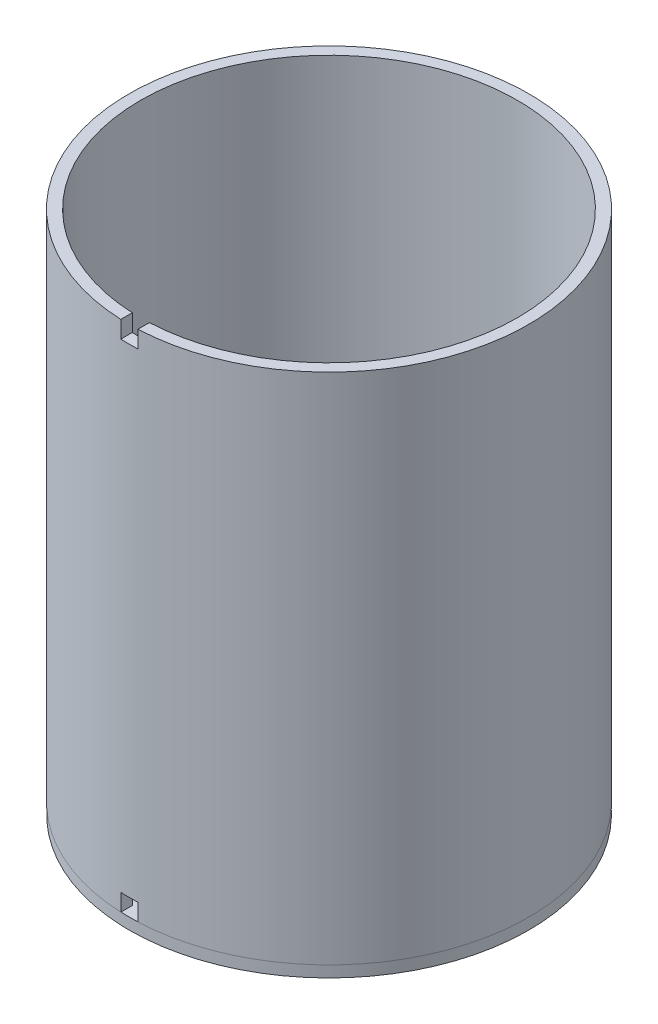
ISO-10303-21;
HEADER;
FILE_DESCRIPTION(('STEP AP214'),'2;1');
FILE_NAME('part.step','',(''),(''),'','','');
FILE_SCHEMA(('AUTOMOTIVE_DESIGN { 1 0 10303 214 1 1 1 1 }'));
ENDSEC;
DATA;
#1=APPLICATION_CONTEXT('core data for automotive mechanical design processes');
#2=APPLICATION_PROTOCOL_DEFINITION('international standard','automotive_design',2000,#1);
#3=PRODUCT_CONTEXT('',#1,'mechanical');
#4=PRODUCT('Part','Part','',(#3));
#5=PRODUCT_RELATED_PRODUCT_CATEGORY('part','',(#4));
#6=PRODUCT_DEFINITION_FORMATION('','',#4);
#7=PRODUCT_DEFINITION_CONTEXT('part definition',#1,'design');
#8=PRODUCT_DEFINITION('design','',#6,#7);
#9=PRODUCT_DEFINITION_SHAPE('','',#8);
#10=(LENGTH_UNIT() NAMED_UNIT(*) SI_UNIT(.MILLI.,.METRE.));
#11=(NAMED_UNIT(*) PLANE_ANGLE_UNIT() SI_UNIT($,.RADIAN.));
#12=(NAMED_UNIT(*) SI_UNIT($,.STERADIAN.) SOLID_ANGLE_UNIT());
#13=UNCERTAINTY_MEASURE_WITH_UNIT(LENGTH_MEASURE(1.E-05),#10,'distance_accuracy_value','');
#14=(GEOMETRIC_REPRESENTATION_CONTEXT(3) GLOBAL_UNCERTAINTY_ASSIGNED_CONTEXT((#13)) GLOBAL_UNIT_ASSIGNED_CONTEXT((#10,
#11,#12)) REPRESENTATION_CONTEXT('',''));
#15=CARTESIAN_POINT('',(0.,0.,0.));
#16=DIRECTION('',(0.,0.,1.));
#17=DIRECTION('',(1.,0.,0.));
#18=AXIS2_PLACEMENT_3D('',#15,#16,#17);
#19=CARTESIAN_POINT('',(0.,233.68,0.));
#20=DIRECTION('',(0.,-1.,0.));
#21=DIRECTION('',(0.,0.,-1.));
#22=AXIS2_PLACEMENT_3D('',#19,#20,#21);
#23=CYLINDRICAL_SURFACE('',#22,88.9698728416405);
#24=CARTESIAN_POINT('',(0.,12.7,0.));
#25=DIRECTION('',(0.,1.,0.));
#26=DIRECTION('',(0.,0.,1.));
#27=AXIS2_PLACEMENT_3D('',#24,#25,#26);
#28=CIRCLE('',#27,88.9698728416405);
#29=CARTESIAN_POINT('',(-3.81000000000005,12.7,88.8882566678956));
#30=VERTEX_POINT('',#29);
#31=CARTESIAN_POINT('',(3.80999999999995,12.7,88.8882566678956));
#32=VERTEX_POINT('',#31);
#33=EDGE_CURVE('E111',#30,#32,#28,.T.);
#34=ORIENTED_EDGE('',*,*,#33,.T.);
#35=DIRECTION('',(0.,-1.,0.));
#36=VECTOR('',#35,1.);
#37=CARTESIAN_POINT('',(3.8100000000001,233.68,88.8882566678956));
#38=LINE('',#37,#36);
#39=CARTESIAN_POINT('',(3.8100000000001,5.08,88.8882566678956));
#40=VERTEX_POINT('',#39);
#41=EDGE_CURVE('E114',#40,#32,#38,.F.);
#42=ORIENTED_EDGE('',*,*,#41,.F.);
#43=CARTESIAN_POINT('',(0.,5.08,0.));
#44=DIRECTION('',(0.,1.,0.));
#45=DIRECTION('',(0.,0.,1.));
#46=AXIS2_PLACEMENT_3D('',#43,#44,#45);
#47=CIRCLE('',#46,88.9698728416405);
#48=CARTESIAN_POINT('',(-3.81000000000005,5.08,88.8882566678956));
#49=VERTEX_POINT('',#48);
#50=EDGE_CURVE('E169',#40,#49,#47,.T.);
#51=ORIENTED_EDGE('',*,*,#50,.T.);
#52=DIRECTION('',(0.,-1.,0.));
#53=VECTOR('',#52,1.);
#54=CARTESIAN_POINT('',(-3.81000000000008,233.68,88.8882566678956));
#55=LINE('',#54,#53);
#56=EDGE_CURVE('E116',#49,#30,#55,.F.);
#57=ORIENTED_EDGE('',*,*,#56,.T.);
#58=EDGE_LOOP('',(#34,#42,#51,#57));
#59=FACE_BOUND('',#58,.T.);
#60=CARTESIAN_POINT('',(0.,233.68,0.));
#61=DIRECTION('',(0.,1.,0.));
#62=DIRECTION('',(0.,0.,1.));
#63=AXIS2_PLACEMENT_3D('',#60,#61,#62);
#64=CIRCLE('',#63,88.9698728416405);
#65=CARTESIAN_POINT('',(3.80999999999994,233.68,88.8882566678956));
#66=VERTEX_POINT('',#65);
#67=CARTESIAN_POINT('',(-3.81000000000005,233.68,88.8882566678956));
#68=VERTEX_POINT('',#67);
#69=EDGE_CURVE('E170',#66,#68,#64,.T.);
#70=ORIENTED_EDGE('',*,*,#69,.F.);
#71=DIRECTION('',(0.,-1.,0.));
#72=VECTOR('',#71,1.);
#73=CARTESIAN_POINT('',(3.80999999999994,233.68,88.8882566678956));
#74=LINE('',#73,#72);
#75=CARTESIAN_POINT('',(3.80999999999995,226.06,88.8882566678956));
#76=VERTEX_POINT('',#75);
#77=EDGE_CURVE('E161',#66,#76,#74,.T.);
#78=ORIENTED_EDGE('',*,*,#77,.T.);
#79=CARTESIAN_POINT('',(0.,226.06,0.));
#80=DIRECTION('',(0.,1.,0.));
#81=DIRECTION('',(0.,0.,1.));
#82=AXIS2_PLACEMENT_3D('',#79,#80,#81);
#83=CIRCLE('',#82,88.9698728416405);
#84=CARTESIAN_POINT('',(-3.81000000000005,226.06,88.8882566678956));
#85=VERTEX_POINT('',#84);
#86=EDGE_CURVE('E122',#85,#76,#83,.T.);
#87=ORIENTED_EDGE('',*,*,#86,.F.);
#88=DIRECTION('',(0.,-1.,0.));
#89=VECTOR('',#88,1.);
#90=CARTESIAN_POINT('',(-3.81000000000005,233.68,88.8882566678956));
#91=LINE('',#90,#89);
#92=EDGE_CURVE('E157',#68,#85,#91,.T.);
#93=ORIENTED_EDGE('',*,*,#92,.F.);
#94=EDGE_LOOP('',(#70,#78,#87,#93));
#95=FACE_BOUND('',#94,.T.);
#96=ADVANCED_FACE('F39',(#59,#95),#23,.T.);
#97=CARTESIAN_POINT('',(0.,5.08,0.));
#98=DIRECTION('',(0.,1.,0.));
#99=DIRECTION('',(0.,0.,1.));
#100=AXIS2_PLACEMENT_3D('',#97,#98,#99);
#101=PLANE('',#100);
#102=CARTESIAN_POINT('',(0.,5.08,0.));
#103=DIRECTION('',(0.,1.,0.));
#104=DIRECTION('',(0.,0.,1.));
#105=AXIS2_PLACEMENT_3D('',#102,#103,#104);
#106=CIRCLE('',#105,83.8898728416405);
#107=CARTESIAN_POINT('',(-3.81000000000005,5.08,83.8033093940007));
#108=VERTEX_POINT('',#107);
#109=CARTESIAN_POINT('',(3.80999999999994,5.08,83.8033093940007));
#110=VERTEX_POINT('',#109);
#111=EDGE_CURVE('E189',#108,#110,#106,.F.);
#112=ORIENTED_EDGE('',*,*,#111,.F.);
#113=DIRECTION('',(0.,0.,-1.));
#114=VECTOR('',#113,1.);
#115=CARTESIAN_POINT('',(-3.81000000000005,5.08,88.9698728416405));
#116=LINE('',#115,#114);
#117=CARTESIAN_POINT('',(-3.81000000000005,5.08,88.8183196193218));
#118=VERTEX_POINT('',#117);
#119=EDGE_CURVE('E144',#118,#108,#116,.T.);
#120=ORIENTED_EDGE('',*,*,#119,.F.);
#121=CARTESIAN_POINT('',(0.,5.08,0.));
#122=DIRECTION('',(0.,1.,0.));
#123=DIRECTION('',(0.,0.,1.));
#124=AXIS2_PLACEMENT_3D('',#121,#122,#123);
#125=CIRCLE('',#124,88.9);
#126=CARTESIAN_POINT('',(3.80999999999994,5.08,88.8183196193218));
#127=VERTEX_POINT('',#126);
#128=EDGE_CURVE('E128',#118,#127,#125,.T.);
#129=ORIENTED_EDGE('',*,*,#128,.T.);
#130=DIRECTION('',(0.,0.,-1.));
#131=VECTOR('',#130,1.);
#132=CARTESIAN_POINT('',(3.80999999999994,5.08,88.9698728416405));
#133=LINE('',#132,#131);
#134=EDGE_CURVE('E136',#127,#110,#133,.T.);
#135=ORIENTED_EDGE('',*,*,#134,.T.);
#136=EDGE_LOOP('',(#112,#120,#129,#135));
#137=FACE_BOUND('',#136,.T.);
#138=CARTESIAN_POINT('',(0.,5.08,0.));
#139=DIRECTION('',(0.,1.,0.));
#140=DIRECTION('',(0.,0.,1.));
#141=AXIS2_PLACEMENT_3D('',#138,#139,#140);
#142=CIRCLE('',#141,38.1);
#143=CARTESIAN_POINT('',(0.,5.08,38.1));
#144=VERTEX_POINT('',#143);
#145=EDGE_CURVE('E177',#144,#144,#142,.T.);
#146=ORIENTED_EDGE('',*,*,#145,.F.);
#147=EDGE_LOOP('',(#146));
#148=FACE_BOUND('',#147,.T.);
#149=ADVANCED_FACE('F244',(#137,#148),#101,.T.);
#150=CARTESIAN_POINT('',(0.,0.,0.));
#151=DIRECTION('',(0.,1.,0.));
#152=DIRECTION('',(0.,0.,1.));
#153=AXIS2_PLACEMENT_3D('',#150,#151,#152);
#154=PLANE('',#153);
#155=CARTESIAN_POINT('',(0.,0.,0.));
#156=DIRECTION('',(0.,1.,0.));
#157=DIRECTION('',(0.,0.,1.));
#158=AXIS2_PLACEMENT_3D('',#155,#156,#157);
#159=CIRCLE('',#158,88.9);
#160=CARTESIAN_POINT('',(0.,0.,88.9));
#161=VERTEX_POINT('',#160);
#162=EDGE_CURVE('E181',#161,#161,#159,.T.);
#163=ORIENTED_EDGE('',*,*,#162,.F.);
#164=EDGE_LOOP('',(#163));
#165=FACE_BOUND('',#164,.T.);
#166=CARTESIAN_POINT('',(0.,0.,0.));
#167=DIRECTION('',(0.,1.,0.));
#168=DIRECTION('',(0.,0.,1.));
#169=AXIS2_PLACEMENT_3D('',#166,#167,#168);
#170=CIRCLE('',#169,38.1);
#171=CARTESIAN_POINT('',(0.,0.,38.1));
#172=VERTEX_POINT('',#171);
#173=EDGE_CURVE('E174',#172,#172,#170,.T.);
#174=ORIENTED_EDGE('',*,*,#173,.T.);
#175=EDGE_LOOP('',(#174));
#176=FACE_BOUND('',#175,.T.);
#177=ADVANCED_FACE('F263',(#165,#176),#154,.F.);
#178=CARTESIAN_POINT('',(0.,5.08,0.));
#179=DIRECTION('',(0.,-1.,0.));
#180=DIRECTION('',(0.,0.,-1.));
#181=AXIS2_PLACEMENT_3D('',#178,#179,#180);
#182=CYLINDRICAL_SURFACE('',#181,88.9);
#183=CARTESIAN_POINT('',(0.,5.08,0.));
#184=DIRECTION('',(0.,1.,0.));
#185=DIRECTION('',(0.,0.,1.));
#186=AXIS2_PLACEMENT_3D('',#183,#184,#185);
#187=CIRCLE('',#186,88.9);
#188=EDGE_CURVE('E185',#127,#118,#187,.T.);
#189=ORIENTED_EDGE('',*,*,#188,.F.);
#190=ORIENTED_EDGE('',*,*,#128,.F.);
#191=EDGE_LOOP('',(#189,#190));
#192=FACE_BOUND('',#191,.T.);
#193=ORIENTED_EDGE('',*,*,#162,.T.);
#194=EDGE_LOOP('',(#193));
#195=FACE_BOUND('',#194,.T.);
#196=ADVANCED_FACE('F41',(#192,#195),#182,.T.);
#197=CARTESIAN_POINT('',(0.,5.08,0.));
#198=DIRECTION('',(0.,-1.,0.));
#199=DIRECTION('',(0.,0.,-1.));
#200=AXIS2_PLACEMENT_3D('',#197,#198,#199);
#201=CYLINDRICAL_SURFACE('',#200,38.1);
#202=ORIENTED_EDGE('',*,*,#145,.T.);
#203=EDGE_LOOP('',(#202));
#204=FACE_BOUND('',#203,.T.);
#205=ORIENTED_EDGE('',*,*,#173,.F.);
#206=EDGE_LOOP('',(#205));
#207=FACE_BOUND('',#206,.T.);
#208=ADVANCED_FACE('F268',(#204,#207),#201,.F.);
#209=CARTESIAN_POINT('',(0.,233.68,0.));
#210=DIRECTION('',(0.,1.,0.));
#211=DIRECTION('',(0.,0.,1.));
#212=AXIS2_PLACEMENT_3D('',#209,#210,#211);
#213=PLANE('',#212);
#214=DIRECTION('',(0.,0.,-1.));
#215=VECTOR('',#214,1.);
#216=CARTESIAN_POINT('',(3.80999999999994,233.68,88.9698728416405));
#217=LINE('',#216,#215);
#218=CARTESIAN_POINT('',(3.80999999999994,233.68,83.8033093940007));
#219=VERTEX_POINT('',#218);
#220=EDGE_CURVE('E129',#66,#219,#217,.T.);
#221=ORIENTED_EDGE('',*,*,#220,.F.);
#222=ORIENTED_EDGE('',*,*,#69,.T.);
#223=DIRECTION('',(0.,0.,-1.));
#224=VECTOR('',#223,1.);
#225=CARTESIAN_POINT('',(-3.81000000000005,233.68,88.9698728416405));
#226=LINE('',#225,#224);
#227=CARTESIAN_POINT('',(-3.81000000000005,233.68,83.8033093940007));
#228=VERTEX_POINT('',#227);
#229=EDGE_CURVE('E218',#68,#228,#226,.T.);
#230=ORIENTED_EDGE('',*,*,#229,.T.);
#231=CARTESIAN_POINT('',(0.,233.68,0.));
#232=DIRECTION('',(0.,1.,0.));
#233=DIRECTION('',(0.,0.,1.));
#234=AXIS2_PLACEMENT_3D('',#231,#232,#233);
#235=CIRCLE('',#234,83.8898728416405);
#236=EDGE_CURVE('E165',#219,#228,#235,.T.);
#237=ORIENTED_EDGE('',*,*,#236,.F.);
#238=EDGE_LOOP('',(#221,#222,#230,#237));
#239=FACE_BOUND('',#238,.T.);
#240=ADVANCED_FACE('F224',(#239),#213,.T.);
#241=CARTESIAN_POINT('',(0.,5.08,0.));
#242=DIRECTION('',(0.,1.,0.));
#243=DIRECTION('',(0.,0.,1.));
#244=AXIS2_PLACEMENT_3D('',#241,#242,#243);
#245=PLANE('',#244);
#246=ORIENTED_EDGE('',*,*,#188,.T.);
#247=EDGE_CURVE('E147',#49,#118,#116,.T.);
#248=ORIENTED_EDGE('',*,*,#247,.F.);
#249=ORIENTED_EDGE('',*,*,#50,.F.);
#250=EDGE_CURVE('E55',#40,#127,#133,.T.);
#251=ORIENTED_EDGE('',*,*,#250,.T.);
#252=EDGE_LOOP('',(#246,#248,#249,#251));
#253=FACE_BOUND('',#252,.T.);
#254=ADVANCED_FACE('F237',(#253),#245,.F.);
#255=CARTESIAN_POINT('',(0.,233.68,0.));
#256=DIRECTION('',(0.,-1.,0.));
#257=DIRECTION('',(0.,0.,-1.));
#258=AXIS2_PLACEMENT_3D('',#255,#256,#257);
#259=CYLINDRICAL_SURFACE('',#258,83.8898728416405);
#260=DIRECTION('',(0.,-1.,0.));
#261=VECTOR('',#260,1.);
#262=CARTESIAN_POINT('',(3.80999999999994,233.68,83.8033093940007));
#263=LINE('',#262,#261);
#264=CARTESIAN_POINT('',(3.80999999999995,226.06,83.8033093940007));
#265=VERTEX_POINT('',#264);
#266=EDGE_CURVE('E11',#219,#265,#263,.T.);
#267=ORIENTED_EDGE('',*,*,#266,.F.);
#268=ORIENTED_EDGE('',*,*,#236,.T.);
#269=DIRECTION('',(0.,-1.,0.));
#270=VECTOR('',#269,1.);
#271=CARTESIAN_POINT('',(-3.81000000000005,233.68,83.8033093940007));
#272=LINE('',#271,#270);
#273=CARTESIAN_POINT('',(-3.81000000000005,226.06,83.8033093940007));
#274=VERTEX_POINT('',#273);
#275=EDGE_CURVE('E48',#228,#274,#272,.T.);
#276=ORIENTED_EDGE('',*,*,#275,.T.);
#277=CARTESIAN_POINT('',(0.,226.06,0.));
#278=DIRECTION('',(0.,1.,0.));
#279=DIRECTION('',(0.,0.,1.));
#280=AXIS2_PLACEMENT_3D('',#277,#278,#279);
#281=CIRCLE('',#280,83.8898728416405);
#282=EDGE_CURVE('E204',#274,#265,#281,.T.);
#283=ORIENTED_EDGE('',*,*,#282,.T.);
#284=EDGE_LOOP('',(#267,#268,#276,#283));
#285=FACE_BOUND('',#284,.T.);
#286=DIRECTION('',(0.,-1.,0.));
#287=VECTOR('',#286,1.);
#288=CARTESIAN_POINT('',(-3.81000000000008,233.68,83.8033093940007));
#289=LINE('',#288,#287);
#290=CARTESIAN_POINT('',(-3.81000000000005,12.7,83.8033093940007));
#291=VERTEX_POINT('',#290);
#292=EDGE_CURVE('E201',#108,#291,#289,.F.);
#293=ORIENTED_EDGE('',*,*,#292,.F.);
#294=ORIENTED_EDGE('',*,*,#111,.T.);
#295=DIRECTION('',(0.,-1.,0.));
#296=VECTOR('',#295,1.);
#297=CARTESIAN_POINT('',(3.8100000000001,233.68,83.8033093940007));
#298=LINE('',#297,#296);
#299=CARTESIAN_POINT('',(3.8100000000001,12.7,83.8033093940007));
#300=VERTEX_POINT('',#299);
#301=EDGE_CURVE('E196',#110,#300,#298,.F.);
#302=ORIENTED_EDGE('',*,*,#301,.T.);
#303=CARTESIAN_POINT('',(0.,12.7,0.));
#304=DIRECTION('',(0.,1.,0.));
#305=DIRECTION('',(0.,0.,1.));
#306=AXIS2_PLACEMENT_3D('',#303,#304,#305);
#307=CIRCLE('',#306,83.8898728416405);
#308=EDGE_CURVE('E133',#291,#300,#307,.T.);
#309=ORIENTED_EDGE('',*,*,#308,.F.);
#310=EDGE_LOOP('',(#293,#294,#302,#309));
#311=FACE_BOUND('',#310,.T.);
#312=ADVANCED_FACE('F211',(#285,#311),#259,.F.);
#313=CARTESIAN_POINT('',(0.,12.7,88.9698728416405));
#314=DIRECTION('',(0.,1.,0.));
#315=DIRECTION('',(0.,0.,1.));
#316=AXIS2_PLACEMENT_3D('',#313,#314,#315);
#317=PLANE('',#316);
#318=ORIENTED_EDGE('',*,*,#33,.F.);
#319=DIRECTION('',(0.,0.,-1.));
#320=VECTOR('',#319,1.);
#321=CARTESIAN_POINT('',(-3.81000000000005,12.7,88.9698728416405));
#322=LINE('',#321,#320);
#323=EDGE_CURVE('E148',#30,#291,#322,.T.);
#324=ORIENTED_EDGE('',*,*,#323,.T.);
#325=ORIENTED_EDGE('',*,*,#308,.T.);
#326=DIRECTION('',(0.,0.,-1.));
#327=VECTOR('',#326,1.);
#328=CARTESIAN_POINT('',(3.80999999999995,12.7,88.9698728416405));
#329=LINE('',#328,#327);
#330=EDGE_CURVE('E125',#32,#300,#329,.T.);
#331=ORIENTED_EDGE('',*,*,#330,.F.);
#332=EDGE_LOOP('',(#318,#324,#325,#331));
#333=FACE_BOUND('',#332,.T.);
#334=ADVANCED_FACE('F131',(#333),#317,.F.);
#335=CARTESIAN_POINT('',(-3.81000000000005,0.,88.9698728416405));
#336=DIRECTION('',(-1.,0.,0.));
#337=DIRECTION('',(0.,-1.,0.));
#338=AXIS2_PLACEMENT_3D('',#335,#336,#337);
#339=PLANE('',#338);
#340=ORIENTED_EDGE('',*,*,#247,.T.);
#341=ORIENTED_EDGE('',*,*,#119,.T.);
#342=ORIENTED_EDGE('',*,*,#292,.T.);
#343=ORIENTED_EDGE('',*,*,#323,.F.);
#344=ORIENTED_EDGE('',*,*,#56,.F.);
#345=EDGE_LOOP('',(#340,#341,#342,#343,#344));
#346=FACE_BOUND('',#345,.T.);
#347=ADVANCED_FACE('F248',(#346),#339,.F.);
#348=CARTESIAN_POINT('',(3.80999999999994,0.,88.9698728416405));
#349=DIRECTION('',(-1.,0.,0.));
#350=DIRECTION('',(0.,-1.,0.));
#351=AXIS2_PLACEMENT_3D('',#348,#349,#350);
#352=PLANE('',#351);
#353=ORIENTED_EDGE('',*,*,#41,.T.);
#354=ORIENTED_EDGE('',*,*,#330,.T.);
#355=ORIENTED_EDGE('',*,*,#301,.F.);
#356=ORIENTED_EDGE('',*,*,#134,.F.);
#357=ORIENTED_EDGE('',*,*,#250,.F.);
#358=EDGE_LOOP('',(#353,#354,#355,#356,#357));
#359=FACE_BOUND('',#358,.T.);
#360=ADVANCED_FACE('F124',(#359),#352,.T.);
#361=CARTESIAN_POINT('',(3.8100000000001,0.,88.9698728416405));
#362=DIRECTION('',(1.,0.,0.));
#363=DIRECTION('',(0.,1.,0.));
#364=AXIS2_PLACEMENT_3D('',#361,#362,#363);
#365=PLANE('',#364);
#366=ORIENTED_EDGE('',*,*,#220,.T.);
#367=ORIENTED_EDGE('',*,*,#266,.T.);
#368=DIRECTION('',(0.,0.,-1.));
#369=VECTOR('',#368,1.);
#370=CARTESIAN_POINT('',(3.80999999999995,226.06,88.9698728416405));
#371=LINE('',#370,#369);
#372=EDGE_CURVE('E63',#76,#265,#371,.T.);
#373=ORIENTED_EDGE('',*,*,#372,.F.);
#374=ORIENTED_EDGE('',*,*,#77,.F.);
#375=EDGE_LOOP('',(#366,#367,#373,#374));
#376=FACE_BOUND('',#375,.T.);
#377=ADVANCED_FACE('F255',(#376),#365,.F.);
#378=CARTESIAN_POINT('',(-3.81000000000008,0.,88.9698728416405));
#379=DIRECTION('',(1.,0.,0.));
#380=DIRECTION('',(0.,1.,0.));
#381=AXIS2_PLACEMENT_3D('',#378,#379,#380);
#382=PLANE('',#381);
#383=ORIENTED_EDGE('',*,*,#92,.T.);
#384=DIRECTION('',(0.,0.,-1.));
#385=VECTOR('',#384,1.);
#386=CARTESIAN_POINT('',(-3.81000000000005,226.06,88.9698728416405));
#387=LINE('',#386,#385);
#388=EDGE_CURVE('E221',#85,#274,#387,.T.);
#389=ORIENTED_EDGE('',*,*,#388,.T.);
#390=ORIENTED_EDGE('',*,*,#275,.F.);
#391=ORIENTED_EDGE('',*,*,#229,.F.);
#392=EDGE_LOOP('',(#383,#389,#390,#391));
#393=FACE_BOUND('',#392,.T.);
#394=ADVANCED_FACE('F217',(#393),#382,.T.);
#395=CARTESIAN_POINT('',(0.,226.06,88.9698728416405));
#396=DIRECTION('',(0.,1.,0.));
#397=DIRECTION('',(0.,0.,1.));
#398=AXIS2_PLACEMENT_3D('',#395,#396,#397);
#399=PLANE('',#398);
#400=ORIENTED_EDGE('',*,*,#86,.T.);
#401=ORIENTED_EDGE('',*,*,#372,.T.);
#402=ORIENTED_EDGE('',*,*,#282,.F.);
#403=ORIENTED_EDGE('',*,*,#388,.F.);
#404=EDGE_LOOP('',(#400,#401,#402,#403));
#405=FACE_BOUND('',#404,.T.);
#406=ADVANCED_FACE('F336',(#405),#399,.T.);
#407=CLOSED_SHELL('',(#96,#149,#177,#196,#208,#240,#254,#312,#334,#347,#360,#377,#394,#406));
#408=MANIFOLD_SOLID_BREP('B2',#407);
#409=ADVANCED_BREP_SHAPE_REPRESENTATION('',(#18,#408),#14);
#410=SHAPE_DEFINITION_REPRESENTATION(#9,#409);
ENDSEC;
END-ISO-10303-21;
